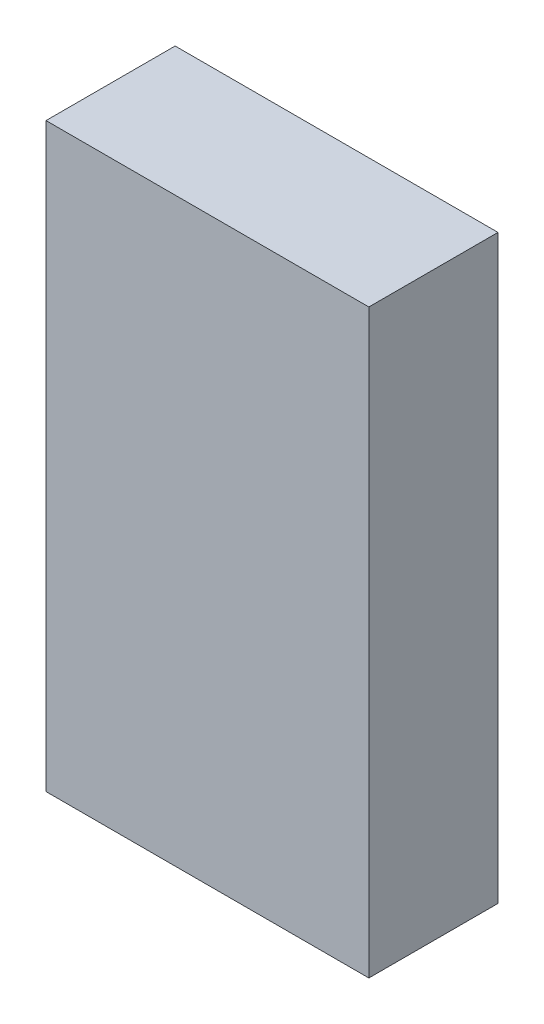
ISO-10303-21;
HEADER;
FILE_DESCRIPTION(('STEP AP214'),'2;1');
FILE_NAME('part.step','',(''),(''),'','','');
FILE_SCHEMA(('AUTOMOTIVE_DESIGN { 1 0 10303 214 1 1 1 1 }'));
ENDSEC;
DATA;
#1=APPLICATION_CONTEXT('core data for automotive mechanical design processes');
#2=APPLICATION_PROTOCOL_DEFINITION('international standard','automotive_design',2000,#1);
#3=PRODUCT_CONTEXT('',#1,'mechanical');
#4=PRODUCT('Part','Part','',(#3));
#5=PRODUCT_RELATED_PRODUCT_CATEGORY('part','',(#4));
#6=PRODUCT_DEFINITION_FORMATION('','',#4);
#7=PRODUCT_DEFINITION_CONTEXT('part definition',#1,'design');
#8=PRODUCT_DEFINITION('design','',#6,#7);
#9=PRODUCT_DEFINITION_SHAPE('','',#8);
#10=(LENGTH_UNIT() NAMED_UNIT(*) SI_UNIT(.MILLI.,.METRE.));
#11=(NAMED_UNIT(*) PLANE_ANGLE_UNIT() SI_UNIT($,.RADIAN.));
#12=(NAMED_UNIT(*) SI_UNIT($,.STERADIAN.) SOLID_ANGLE_UNIT());
#13=UNCERTAINTY_MEASURE_WITH_UNIT(LENGTH_MEASURE(1.E-05),#10,'distance_accuracy_value','');
#14=(GEOMETRIC_REPRESENTATION_CONTEXT(3) GLOBAL_UNCERTAINTY_ASSIGNED_CONTEXT((#13)) GLOBAL_UNIT_ASSIGNED_CONTEXT((#10,
#11,#12)) REPRESENTATION_CONTEXT('',''));
#15=CARTESIAN_POINT('',(0.,0.,0.));
#16=DIRECTION('',(0.,0.,1.));
#17=DIRECTION('',(1.,0.,0.));
#18=AXIS2_PLACEMENT_3D('',#15,#16,#17);
#19=CARTESIAN_POINT('',(0.375,-2.05,0.));
#20=DIRECTION('',(1.,0.,0.));
#21=DIRECTION('',(0.,0.,1.));
#22=AXIS2_PLACEMENT_3D('',#19,#20,#21);
#23=PLANE('',#22);
#24=DIRECTION('',(0.,1.,0.));
#25=VECTOR('',#24,1.);
#26=CARTESIAN_POINT('',(0.375,-2.05,0.1));
#27=LINE('',#26,#25);
#28=CARTESIAN_POINT('',(0.375,-2.05,0.1));
#29=VERTEX_POINT('',#28);
#30=CARTESIAN_POINT('',(0.375,-1.6,0.1));
#31=VERTEX_POINT('',#30);
#32=EDGE_CURVE('E11',#29,#31,#27,.T.);
#33=ORIENTED_EDGE('',*,*,#32,.T.);
#34=DIRECTION('',(0.,0.,1.));
#35=VECTOR('',#34,1.);
#36=CARTESIAN_POINT('',(0.375,-1.6,0.));
#37=LINE('',#36,#35);
#38=CARTESIAN_POINT('',(0.375,-1.6,0.));
#39=VERTEX_POINT('',#38);
#40=EDGE_CURVE('E24',#39,#31,#37,.T.);
#41=ORIENTED_EDGE('',*,*,#40,.F.);
#42=DIRECTION('',(0.,1.,0.));
#43=VECTOR('',#42,1.);
#44=CARTESIAN_POINT('',(0.375,-2.05,0.));
#45=LINE('',#44,#43);
#46=CARTESIAN_POINT('',(0.375,-2.05,0.));
#47=VERTEX_POINT('',#46);
#48=EDGE_CURVE('E86',#47,#39,#45,.T.);
#49=ORIENTED_EDGE('',*,*,#48,.F.);
#50=DIRECTION('',(0.,0.,1.));
#51=VECTOR('',#50,1.);
#52=CARTESIAN_POINT('',(0.375,-2.05,0.));
#53=LINE('',#52,#51);
#54=EDGE_CURVE('E36',#47,#29,#53,.T.);
#55=ORIENTED_EDGE('',*,*,#54,.T.);
#56=EDGE_LOOP('',(#33,#41,#49,#55));
#57=FACE_BOUND('',#56,.T.);
#58=ADVANCED_FACE('F17',(#57),#23,.F.);
#59=CARTESIAN_POINT('',(0.625,-2.05,0.));
#60=DIRECTION('',(1.,0.,0.));
#61=DIRECTION('',(0.,0.,1.));
#62=AXIS2_PLACEMENT_3D('',#59,#60,#61);
#63=PLANE('',#62);
#64=DIRECTION('',(0.,0.,1.));
#65=VECTOR('',#64,1.);
#66=CARTESIAN_POINT('',(0.625,-2.05,0.));
#67=LINE('',#66,#65);
#68=CARTESIAN_POINT('',(0.625,-2.05,0.));
#69=VERTEX_POINT('',#68);
#70=CARTESIAN_POINT('',(0.625,-2.05,0.1));
#71=VERTEX_POINT('',#70);
#72=EDGE_CURVE('E83',#69,#71,#67,.T.);
#73=ORIENTED_EDGE('',*,*,#72,.F.);
#74=DIRECTION('',(0.,1.,0.));
#75=VECTOR('',#74,1.);
#76=CARTESIAN_POINT('',(0.625,-2.05,0.));
#77=LINE('',#76,#75);
#78=CARTESIAN_POINT('',(0.625,-1.6,0.));
#79=VERTEX_POINT('',#78);
#80=EDGE_CURVE('E63',#69,#79,#77,.T.);
#81=ORIENTED_EDGE('',*,*,#80,.T.);
#82=DIRECTION('',(0.,0.,1.));
#83=VECTOR('',#82,1.);
#84=CARTESIAN_POINT('',(0.625,-1.6,0.));
#85=LINE('',#84,#83);
#86=CARTESIAN_POINT('',(0.625,-1.6,0.1));
#87=VERTEX_POINT('',#86);
#88=EDGE_CURVE('E57',#79,#87,#85,.T.);
#89=ORIENTED_EDGE('',*,*,#88,.T.);
#90=DIRECTION('',(0.,1.,0.));
#91=VECTOR('',#90,1.);
#92=CARTESIAN_POINT('',(0.625,-2.05,0.1));
#93=LINE('',#92,#91);
#94=EDGE_CURVE('E60',#71,#87,#93,.T.);
#95=ORIENTED_EDGE('',*,*,#94,.F.);
#96=EDGE_LOOP('',(#73,#81,#89,#95));
#97=FACE_BOUND('',#96,.T.);
#98=ADVANCED_FACE('F59',(#97),#63,.T.);
#99=CARTESIAN_POINT('',(0.375,-2.05,0.));
#100=DIRECTION('',(0.,1.,0.));
#101=DIRECTION('',(0.,0.,1.));
#102=AXIS2_PLACEMENT_3D('',#99,#100,#101);
#103=PLANE('',#102);
#104=ORIENTED_EDGE('',*,*,#72,.T.);
#105=DIRECTION('',(1.,0.,0.));
#106=VECTOR('',#105,1.);
#107=CARTESIAN_POINT('',(0.375,-2.05,0.1));
#108=LINE('',#107,#106);
#109=EDGE_CURVE('E71',#29,#71,#108,.T.);
#110=ORIENTED_EDGE('',*,*,#109,.F.);
#111=ORIENTED_EDGE('',*,*,#54,.F.);
#112=DIRECTION('',(1.,0.,0.));
#113=VECTOR('',#112,1.);
#114=CARTESIAN_POINT('',(0.375,-2.05,0.));
#115=LINE('',#114,#113);
#116=EDGE_CURVE('E76',#47,#69,#115,.T.);
#117=ORIENTED_EDGE('',*,*,#116,.T.);
#118=EDGE_LOOP('',(#104,#110,#111,#117));
#119=FACE_BOUND('',#118,.T.);
#120=ADVANCED_FACE('F91',(#119),#103,.F.);
#121=CARTESIAN_POINT('',(0.375,-1.6,0.));
#122=DIRECTION('',(0.,1.,0.));
#123=DIRECTION('',(0.,0.,1.));
#124=AXIS2_PLACEMENT_3D('',#121,#122,#123);
#125=PLANE('',#124);
#126=DIRECTION('',(1.,0.,0.));
#127=VECTOR('',#126,1.);
#128=CARTESIAN_POINT('',(0.375,-1.6,0.));
#129=LINE('',#128,#127);
#130=EDGE_CURVE('E74',#39,#79,#129,.T.);
#131=ORIENTED_EDGE('',*,*,#130,.F.);
#132=ORIENTED_EDGE('',*,*,#40,.T.);
#133=DIRECTION('',(1.,0.,0.));
#134=VECTOR('',#133,1.);
#135=CARTESIAN_POINT('',(0.375,-1.6,0.1));
#136=LINE('',#135,#134);
#137=EDGE_CURVE('E69',#31,#87,#136,.T.);
#138=ORIENTED_EDGE('',*,*,#137,.T.);
#139=ORIENTED_EDGE('',*,*,#88,.F.);
#140=EDGE_LOOP('',(#131,#132,#138,#139));
#141=FACE_BOUND('',#140,.T.);
#142=ADVANCED_FACE('F73',(#141),#125,.T.);
#143=CARTESIAN_POINT('',(0.375,-2.05,0.));
#144=DIRECTION('',(0.,0.,1.));
#145=DIRECTION('',(1.,0.,0.));
#146=AXIS2_PLACEMENT_3D('',#143,#144,#145);
#147=PLANE('',#146);
#148=ORIENTED_EDGE('',*,*,#130,.T.);
#149=ORIENTED_EDGE('',*,*,#80,.F.);
#150=ORIENTED_EDGE('',*,*,#116,.F.);
#151=ORIENTED_EDGE('',*,*,#48,.T.);
#152=EDGE_LOOP('',(#148,#149,#150,#151));
#153=FACE_BOUND('',#152,.T.);
#154=ADVANCED_FACE('F89',(#153),#147,.F.);
#155=CARTESIAN_POINT('',(0.375,-2.05,0.1));
#156=DIRECTION('',(0.,0.,1.));
#157=DIRECTION('',(1.,0.,0.));
#158=AXIS2_PLACEMENT_3D('',#155,#156,#157);
#159=PLANE('',#158);
#160=ORIENTED_EDGE('',*,*,#32,.F.);
#161=ORIENTED_EDGE('',*,*,#109,.T.);
#162=ORIENTED_EDGE('',*,*,#94,.T.);
#163=ORIENTED_EDGE('',*,*,#137,.F.);
#164=EDGE_LOOP('',(#160,#161,#162,#163));
#165=FACE_BOUND('',#164,.T.);
#166=ADVANCED_FACE('F68',(#165),#159,.T.);
#167=CLOSED_SHELL('',(#58,#98,#120,#142,#154,#166));
#168=MANIFOLD_SOLID_BREP('B1',#167);
#169=ADVANCED_BREP_SHAPE_REPRESENTATION('',(#18,#168),#14);
#170=SHAPE_DEFINITION_REPRESENTATION(#9,#169);
ENDSEC;
END-ISO-10303-21;
